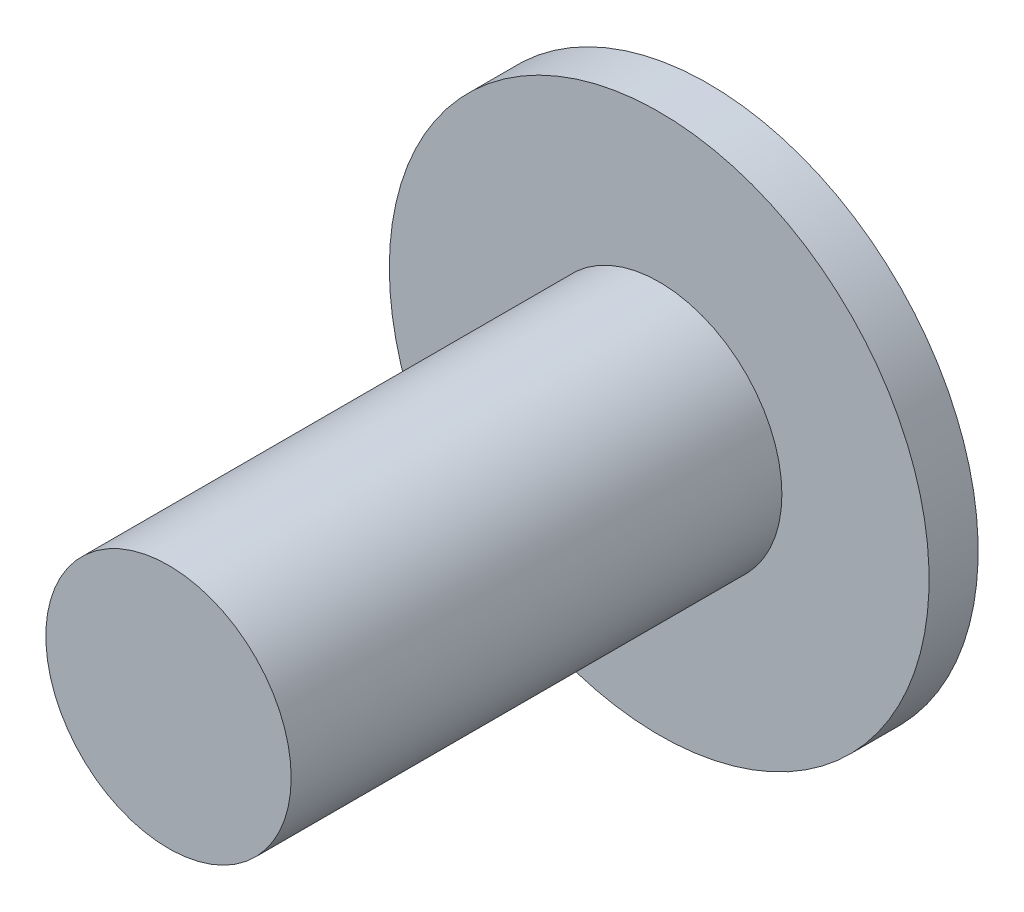
ISO-10303-21;
HEADER;
FILE_DESCRIPTION(('STEP AP214'),'2;1');
FILE_NAME('part.step','',(''),(''),'','','');
FILE_SCHEMA(('AUTOMOTIVE_DESIGN { 1 0 10303 214 1 1 1 1 }'));
ENDSEC;
DATA;
#1=APPLICATION_CONTEXT('core data for automotive mechanical design processes');
#2=APPLICATION_PROTOCOL_DEFINITION('international standard','automotive_design',2000,#1);
#3=PRODUCT_CONTEXT('',#1,'mechanical');
#4=PRODUCT('Part','Part','',(#3));
#5=PRODUCT_RELATED_PRODUCT_CATEGORY('part','',(#4));
#6=PRODUCT_DEFINITION_FORMATION('','',#4);
#7=PRODUCT_DEFINITION_CONTEXT('part definition',#1,'design');
#8=PRODUCT_DEFINITION('design','',#6,#7);
#9=PRODUCT_DEFINITION_SHAPE('','',#8);
#10=(LENGTH_UNIT() NAMED_UNIT(*) SI_UNIT(.MILLI.,.METRE.));
#11=(NAMED_UNIT(*) PLANE_ANGLE_UNIT() SI_UNIT($,.RADIAN.));
#12=(NAMED_UNIT(*) SI_UNIT($,.STERADIAN.) SOLID_ANGLE_UNIT());
#13=UNCERTAINTY_MEASURE_WITH_UNIT(LENGTH_MEASURE(1.E-05),#10,'distance_accuracy_value','');
#14=(GEOMETRIC_REPRESENTATION_CONTEXT(3) GLOBAL_UNCERTAINTY_ASSIGNED_CONTEXT((#13)) GLOBAL_UNIT_ASSIGNED_CONTEXT((#10,
#11,#12)) REPRESENTATION_CONTEXT('',''));
#15=CARTESIAN_POINT('',(0.,0.,0.));
#16=DIRECTION('',(0.,0.,1.));
#17=DIRECTION('',(1.,0.,0.));
#18=AXIS2_PLACEMENT_3D('',#15,#16,#17);
#19=CARTESIAN_POINT('',(0.,0.,0.));
#20=DIRECTION('',(0.,0.,1.));
#21=DIRECTION('',(1.,0.,0.));
#22=AXIS2_PLACEMENT_3D('',#19,#20,#21);
#23=PLANE('',#22);
#24=DIRECTION('',(-0.469290027831136,-0.883044092771279,0.));
#25=VECTOR('',#24,1.);
#26=CARTESIAN_POINT('',(0.795140404629213,-1.27190869834517,0.));
#27=LINE('',#26,#25);
#28=CARTESIAN_POINT('',(1.49907544637592,0.0526574408117542,0.));
#29=VERTEX_POINT('',#28);
#30=CARTESIAN_POINT('',(0.795140404629213,-1.27190869834517,0.));
#31=VERTEX_POINT('',#30);
#32=EDGE_CURVE('E105',#29,#31,#27,.T.);
#33=ORIENTED_EDGE('',*,*,#32,.F.);
#34=DIRECTION('',(0.530093603086142,-0.84793913223011,0.));
#35=VECTOR('',#34,1.);
#36=CARTESIAN_POINT('',(1.49907544637592,0.0526574408117542,0.));
#37=LINE('',#36,#35);
#38=CARTESIAN_POINT('',(0.703935041746705,1.32456613915692,0.));
#39=VERTEX_POINT('',#38);
#40=EDGE_CURVE('E141',#39,#29,#37,.T.);
#41=ORIENTED_EDGE('',*,*,#40,.F.);
#42=DIRECTION('',(0.999383630917278,0.0351049605411693,0.));
#43=VECTOR('',#42,1.);
#44=CARTESIAN_POINT('',(0.703935041746705,1.32456613915692,0.));
#45=LINE('',#44,#43);
#46=CARTESIAN_POINT('',(-0.795140404629213,1.27190869834517,0.));
#47=VERTEX_POINT('',#46);
#48=EDGE_CURVE('E168',#47,#39,#45,.T.);
#49=ORIENTED_EDGE('',*,*,#48,.F.);
#50=DIRECTION('',(0.469290027831136,0.883044092771279,0.));
#51=VECTOR('',#50,1.);
#52=CARTESIAN_POINT('',(-0.795140404629213,1.27190869834517,0.));
#53=LINE('',#52,#51);
#54=CARTESIAN_POINT('',(-1.49907544637592,-0.0526574408117536,0.));
#55=VERTEX_POINT('',#54);
#56=EDGE_CURVE('E144',#55,#47,#53,.T.);
#57=ORIENTED_EDGE('',*,*,#56,.F.);
#58=DIRECTION('',(-0.530093603086142,0.84793913223011,0.));
#59=VECTOR('',#58,1.);
#60=CARTESIAN_POINT('',(-1.49907544637592,-0.0526574408117536,0.));
#61=LINE('',#60,#59);
#62=CARTESIAN_POINT('',(-0.703935041746705,-1.32456613915692,0.));
#63=VERTEX_POINT('',#62);
#64=EDGE_CURVE('E20',#63,#55,#61,.T.);
#65=ORIENTED_EDGE('',*,*,#64,.F.);
#66=DIRECTION('',(-0.999383630917278,-0.0351049605411689,0.));
#67=VECTOR('',#66,1.);
#68=CARTESIAN_POINT('',(-0.703935041746705,-1.32456613915692,0.));
#69=LINE('',#68,#67);
#70=EDGE_CURVE('E109',#31,#63,#69,.T.);
#71=ORIENTED_EDGE('',*,*,#70,.F.);
#72=EDGE_LOOP('',(#33,#41,#49,#57,#65,#71));
#73=FACE_BOUND('',#72,.T.);
#74=CARTESIAN_POINT('',(0.,0.,0.));
#75=DIRECTION('',(0.,0.,1.));
#76=DIRECTION('',(1.,0.,0.));
#77=AXIS2_PLACEMENT_3D('',#74,#75,#76);
#78=CIRCLE('',#77,5.5);
#79=CARTESIAN_POINT('',(-5.5,0.,0.));
#80=VERTEX_POINT('',#79);
#81=EDGE_CURVE('E10',#80,#80,#78,.T.);
#82=ORIENTED_EDGE('',*,*,#81,.F.);
#83=EDGE_LOOP('',(#82));
#84=FACE_BOUND('',#83,.T.);
#85=ADVANCED_FACE('F16',(#73,#84),#23,.F.);
#86=CARTESIAN_POINT('',(0.,0.,1.));
#87=DIRECTION('',(0.,0.,1.));
#88=DIRECTION('',(1.,0.,0.));
#89=AXIS2_PLACEMENT_3D('',#86,#87,#88);
#90=PLANE('',#89);
#91=CARTESIAN_POINT('',(0.,0.,1.));
#92=DIRECTION('',(0.,0.,-1.));
#93=DIRECTION('',(-1.,0.,0.));
#94=AXIS2_PLACEMENT_3D('',#91,#92,#93);
#95=CIRCLE('',#94,2.5);
#96=CARTESIAN_POINT('',(2.5,0.,1.));
#97=VERTEX_POINT('',#96);
#98=EDGE_CURVE('E139',#97,#97,#95,.T.);
#99=ORIENTED_EDGE('',*,*,#98,.T.);
#100=EDGE_LOOP('',(#99));
#101=FACE_BOUND('',#100,.T.);
#102=CARTESIAN_POINT('',(0.,0.,1.));
#103=DIRECTION('',(0.,0.,1.));
#104=DIRECTION('',(1.,0.,0.));
#105=AXIS2_PLACEMENT_3D('',#102,#103,#104);
#106=CIRCLE('',#105,5.5);
#107=CARTESIAN_POINT('',(-5.5,0.,1.));
#108=VERTEX_POINT('',#107);
#109=EDGE_CURVE('E136',#108,#108,#106,.T.);
#110=ORIENTED_EDGE('',*,*,#109,.T.);
#111=EDGE_LOOP('',(#110));
#112=FACE_BOUND('',#111,.T.);
#113=ADVANCED_FACE('F216',(#101,#112),#90,.T.);
#114=CARTESIAN_POINT('',(0.,0.,0.));
#115=DIRECTION('',(0.,0.,1.));
#116=DIRECTION('',(1.,0.,0.));
#117=AXIS2_PLACEMENT_3D('',#114,#115,#116);
#118=CYLINDRICAL_SURFACE('',#117,5.5);
#119=ORIENTED_EDGE('',*,*,#109,.F.);
#120=DIRECTION('',(0.,0.,-1.));
#121=VECTOR('',#120,1.);
#122=CARTESIAN_POINT('',(-5.5,0.,0.));
#123=LINE('',#122,#121);
#124=EDGE_CURVE('E27',#108,#80,#123,.T.);
#125=ORIENTED_EDGE('',*,*,#124,.T.);
#126=ORIENTED_EDGE('',*,*,#81,.T.);
#127=ORIENTED_EDGE('',*,*,#124,.F.);
#128=EDGE_LOOP('',(#119,#125,#126,#127));
#129=FACE_BOUND('',#128,.T.);
#130=ADVANCED_FACE('F222',(#129),#118,.T.);
#131=CARTESIAN_POINT('',(1.49907544637592,0.0526574408117539,0.));
#132=DIRECTION('',(-0.883044092771279,0.469290027831137,0.));
#133=DIRECTION('',(0.,0.,1.));
#134=AXIS2_PLACEMENT_3D('',#131,#132,#133);
#135=PLANE('',#134);
#136=ORIENTED_EDGE('',*,*,#32,.T.);
#137=DIRECTION('',(0.,0.,1.));
#138=VECTOR('',#137,1.);
#139=CARTESIAN_POINT('',(0.795140404629213,-1.27190869834517,0.));
#140=LINE('',#139,#138);
#141=CARTESIAN_POINT('',(0.795140404629213,-1.27190869834517,2.5));
#142=VERTEX_POINT('',#141);
#143=EDGE_CURVE('E98',#31,#142,#140,.T.);
#144=ORIENTED_EDGE('',*,*,#143,.T.);
#145=DIRECTION('',(0.469290027831136,0.883044092771279,0.));
#146=VECTOR('',#145,1.);
#147=CARTESIAN_POINT('',(0.795140404629213,-1.27190869834517,2.5));
#148=LINE('',#147,#146);
#149=CARTESIAN_POINT('',(1.49907544637592,0.0526574408117542,2.5));
#150=VERTEX_POINT('',#149);
#151=EDGE_CURVE('E103',#142,#150,#148,.T.);
#152=ORIENTED_EDGE('',*,*,#151,.T.);
#153=DIRECTION('',(0.,0.,1.));
#154=VECTOR('',#153,1.);
#155=CARTESIAN_POINT('',(1.49907544637592,0.0526574408117542,0.));
#156=LINE('',#155,#154);
#157=EDGE_CURVE('E152',#29,#150,#156,.T.);
#158=ORIENTED_EDGE('',*,*,#157,.F.);
#159=EDGE_LOOP('',(#136,#144,#152,#158));
#160=FACE_BOUND('',#159,.T.);
#161=ADVANCED_FACE('F100',(#160),#135,.T.);
#162=CARTESIAN_POINT('',(0.795140404629213,-1.27190869834517,0.));
#163=DIRECTION('',(-0.0351049605411689,0.999383630917278,0.));
#164=DIRECTION('',(0.,0.,1.));
#165=AXIS2_PLACEMENT_3D('',#162,#163,#164);
#166=PLANE('',#165);
#167=ORIENTED_EDGE('',*,*,#70,.T.);
#168=DIRECTION('',(0.,0.,1.));
#169=VECTOR('',#168,1.);
#170=CARTESIAN_POINT('',(-0.703935041746705,-1.32456613915692,0.));
#171=LINE('',#170,#169);
#172=CARTESIAN_POINT('',(-0.703935041746705,-1.32456613915692,2.5));
#173=VERTEX_POINT('',#172);
#174=EDGE_CURVE('E115',#63,#173,#171,.T.);
#175=ORIENTED_EDGE('',*,*,#174,.T.);
#176=DIRECTION('',(0.999383630917278,0.0351049605411689,0.));
#177=VECTOR('',#176,1.);
#178=CARTESIAN_POINT('',(-0.703935041746705,-1.32456613915692,2.5));
#179=LINE('',#178,#177);
#180=EDGE_CURVE('E112',#173,#142,#179,.T.);
#181=ORIENTED_EDGE('',*,*,#180,.T.);
#182=ORIENTED_EDGE('',*,*,#143,.F.);
#183=EDGE_LOOP('',(#167,#175,#181,#182));
#184=FACE_BOUND('',#183,.T.);
#185=ADVANCED_FACE('F113',(#184),#166,.T.);
#186=CARTESIAN_POINT('',(-0.703935041746705,-1.32456613915692,0.));
#187=DIRECTION('',(0.84793913223011,0.530093603086142,0.));
#188=DIRECTION('',(0.,0.,-1.));
#189=AXIS2_PLACEMENT_3D('',#186,#187,#188);
#190=PLANE('',#189);
#191=ORIENTED_EDGE('',*,*,#64,.T.);
#192=DIRECTION('',(0.,0.,1.));
#193=VECTOR('',#192,1.);
#194=CARTESIAN_POINT('',(-1.49907544637592,-0.0526574408117536,0.));
#195=LINE('',#194,#193);
#196=CARTESIAN_POINT('',(-1.49907544637592,-0.0526574408117536,2.5));
#197=VERTEX_POINT('',#196);
#198=EDGE_CURVE('E146',#55,#197,#195,.T.);
#199=ORIENTED_EDGE('',*,*,#198,.T.);
#200=DIRECTION('',(0.530093603086142,-0.84793913223011,0.));
#201=VECTOR('',#200,1.);
#202=CARTESIAN_POINT('',(-1.49907544637592,-0.0526574408117536,2.5));
#203=LINE('',#202,#201);
#204=EDGE_CURVE('E120',#197,#173,#203,.T.);
#205=ORIENTED_EDGE('',*,*,#204,.T.);
#206=ORIENTED_EDGE('',*,*,#174,.F.);
#207=EDGE_LOOP('',(#191,#199,#205,#206));
#208=FACE_BOUND('',#207,.T.);
#209=ADVANCED_FACE('F199',(#208),#190,.T.);
#210=CARTESIAN_POINT('',(-1.49907544637592,-0.0526574408117536,0.));
#211=DIRECTION('',(0.883044092771279,-0.469290027831136,0.));
#212=DIRECTION('',(0.,0.,-1.));
#213=AXIS2_PLACEMENT_3D('',#210,#211,#212);
#214=PLANE('',#213);
#215=ORIENTED_EDGE('',*,*,#56,.T.);
#216=DIRECTION('',(0.,0.,1.));
#217=VECTOR('',#216,1.);
#218=CARTESIAN_POINT('',(-0.795140404629213,1.27190869834517,0.));
#219=LINE('',#218,#217);
#220=CARTESIAN_POINT('',(-0.795140404629213,1.27190869834517,2.5));
#221=VERTEX_POINT('',#220);
#222=EDGE_CURVE('E147',#47,#221,#219,.T.);
#223=ORIENTED_EDGE('',*,*,#222,.T.);
#224=DIRECTION('',(-0.469290027831136,-0.883044092771279,0.));
#225=VECTOR('',#224,1.);
#226=CARTESIAN_POINT('',(-0.795140404629213,1.27190869834517,2.5));
#227=LINE('',#226,#225);
#228=EDGE_CURVE('E153',#221,#197,#227,.T.);
#229=ORIENTED_EDGE('',*,*,#228,.T.);
#230=ORIENTED_EDGE('',*,*,#198,.F.);
#231=EDGE_LOOP('',(#215,#223,#229,#230));
#232=FACE_BOUND('',#231,.T.);
#233=ADVANCED_FACE('F203',(#232),#214,.T.);
#234=CARTESIAN_POINT('',(-0.795140404629213,1.27190869834517,0.));
#235=DIRECTION('',(0.0351049605411693,-0.999383630917278,0.));
#236=DIRECTION('',(0.,0.,-1.));
#237=AXIS2_PLACEMENT_3D('',#234,#235,#236);
#238=PLANE('',#237);
#239=ORIENTED_EDGE('',*,*,#48,.T.);
#240=DIRECTION('',(0.,0.,1.));
#241=VECTOR('',#240,1.);
#242=CARTESIAN_POINT('',(0.703935041746705,1.32456613915692,0.));
#243=LINE('',#242,#241);
#244=CARTESIAN_POINT('',(0.703935041746705,1.32456613915692,2.5));
#245=VERTEX_POINT('',#244);
#246=EDGE_CURVE('E169',#39,#245,#243,.T.);
#247=ORIENTED_EDGE('',*,*,#246,.T.);
#248=DIRECTION('',(-0.999383630917278,-0.0351049605411693,0.));
#249=VECTOR('',#248,1.);
#250=CARTESIAN_POINT('',(0.703935041746705,1.32456613915692,2.5));
#251=LINE('',#250,#249);
#252=EDGE_CURVE('E157',#245,#221,#251,.T.);
#253=ORIENTED_EDGE('',*,*,#252,.T.);
#254=ORIENTED_EDGE('',*,*,#222,.F.);
#255=EDGE_LOOP('',(#239,#247,#253,#254));
#256=FACE_BOUND('',#255,.T.);
#257=ADVANCED_FACE('F18',(#256),#238,.T.);
#258=CARTESIAN_POINT('',(0.703935041746705,1.32456613915692,0.));
#259=DIRECTION('',(-0.84793913223011,-0.530093603086142,0.));
#260=DIRECTION('',(-0.530093603086142,0.84793913223011,0.));
#261=AXIS2_PLACEMENT_3D('',#258,#259,#260);
#262=PLANE('',#261);
#263=ORIENTED_EDGE('',*,*,#40,.T.);
#264=ORIENTED_EDGE('',*,*,#157,.T.);
#265=DIRECTION('',(-0.530093603086142,0.84793913223011,0.));
#266=VECTOR('',#265,1.);
#267=CARTESIAN_POINT('',(1.49907544637592,0.0526574408117542,2.5));
#268=LINE('',#267,#266);
#269=EDGE_CURVE('E125',#150,#245,#268,.T.);
#270=ORIENTED_EDGE('',*,*,#269,.T.);
#271=ORIENTED_EDGE('',*,*,#246,.F.);
#272=EDGE_LOOP('',(#263,#264,#270,#271));
#273=FACE_BOUND('',#272,.T.);
#274=ADVANCED_FACE('F190',(#273),#262,.T.);
#275=CARTESIAN_POINT('',(0.,0.,1.));
#276=DIRECTION('',(0.,0.,1.));
#277=DIRECTION('',(-1.,0.,0.));
#278=AXIS2_PLACEMENT_3D('',#275,#276,#277);
#279=CYLINDRICAL_SURFACE('',#278,2.5);
#280=CARTESIAN_POINT('',(0.,0.,11.));
#281=DIRECTION('',(0.,0.,-1.));
#282=DIRECTION('',(-1.,0.,0.));
#283=AXIS2_PLACEMENT_3D('',#280,#281,#282);
#284=CIRCLE('',#283,2.5);
#285=CARTESIAN_POINT('',(2.5,0.,11.));
#286=VERTEX_POINT('',#285);
#287=EDGE_CURVE('E131',#286,#286,#284,.T.);
#288=ORIENTED_EDGE('',*,*,#287,.T.);
#289=DIRECTION('',(0.,0.,-1.));
#290=VECTOR('',#289,1.);
#291=CARTESIAN_POINT('',(2.5,0.,1.));
#292=LINE('',#291,#290);
#293=EDGE_CURVE('E142',#286,#97,#292,.T.);
#294=ORIENTED_EDGE('',*,*,#293,.T.);
#295=ORIENTED_EDGE('',*,*,#98,.F.);
#296=ORIENTED_EDGE('',*,*,#293,.F.);
#297=EDGE_LOOP('',(#288,#294,#295,#296));
#298=FACE_BOUND('',#297,.T.);
#299=ADVANCED_FACE('F213',(#298),#279,.T.);
#300=CARTESIAN_POINT('',(0.,0.,2.5));
#301=DIRECTION('',(0.,0.,1.));
#302=DIRECTION('',(1.,0.,0.));
#303=AXIS2_PLACEMENT_3D('',#300,#301,#302);
#304=PLANE('',#303);
#305=ORIENTED_EDGE('',*,*,#269,.F.);
#306=ORIENTED_EDGE('',*,*,#151,.F.);
#307=ORIENTED_EDGE('',*,*,#180,.F.);
#308=ORIENTED_EDGE('',*,*,#204,.F.);
#309=ORIENTED_EDGE('',*,*,#228,.F.);
#310=ORIENTED_EDGE('',*,*,#252,.F.);
#311=EDGE_LOOP('',(#305,#306,#307,#308,#309,#310));
#312=FACE_BOUND('',#311,.T.);
#313=ADVANCED_FACE('F122',(#312),#304,.F.);
#314=CARTESIAN_POINT('',(0.,0.,11.));
#315=DIRECTION('',(0.,0.,1.));
#316=DIRECTION('',(1.,0.,0.));
#317=AXIS2_PLACEMENT_3D('',#314,#315,#316);
#318=PLANE('',#317);
#319=ORIENTED_EDGE('',*,*,#287,.F.);
#320=EDGE_LOOP('',(#319));
#321=FACE_BOUND('',#320,.T.);
#322=ADVANCED_FACE('F238',(#321),#318,.T.);
#323=CLOSED_SHELL('',(#85,#113,#130,#161,#185,#209,#233,#257,#274,#299,#313,#322));
#324=MANIFOLD_SOLID_BREP('B1',#323);
#325=ADVANCED_BREP_SHAPE_REPRESENTATION('',(#18,#324),#14);
#326=SHAPE_DEFINITION_REPRESENTATION(#9,#325);
ENDSEC;
END-ISO-10303-21;
